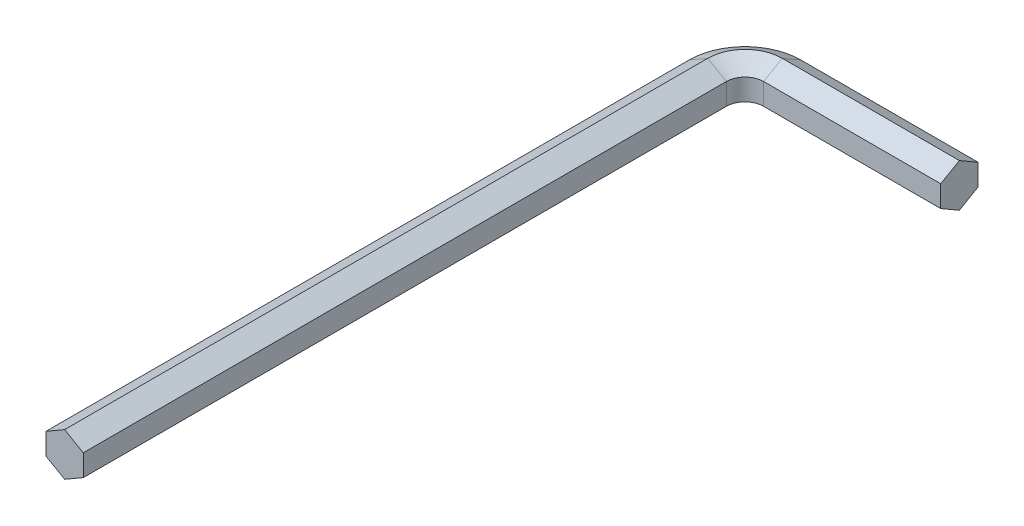
ISO-10303-21;
HEADER;
FILE_DESCRIPTION(('STEP AP214'),'2;1');
FILE_NAME('part.step','',(''),(''),'','','');
FILE_SCHEMA(('AUTOMOTIVE_DESIGN { 1 0 10303 214 1 1 1 1 }'));
ENDSEC;
DATA;
#1=APPLICATION_CONTEXT('core data for automotive mechanical design processes');
#2=APPLICATION_PROTOCOL_DEFINITION('international standard','automotive_design',2000,#1);
#3=PRODUCT_CONTEXT('',#1,'mechanical');
#4=PRODUCT('Part','Part','',(#3));
#5=PRODUCT_RELATED_PRODUCT_CATEGORY('part','',(#4));
#6=PRODUCT_DEFINITION_FORMATION('','',#4);
#7=PRODUCT_DEFINITION_CONTEXT('part definition',#1,'design');
#8=PRODUCT_DEFINITION('design','',#6,#7);
#9=PRODUCT_DEFINITION_SHAPE('','',#8);
#10=(LENGTH_UNIT() NAMED_UNIT(*) SI_UNIT(.MILLI.,.METRE.));
#11=(NAMED_UNIT(*) PLANE_ANGLE_UNIT() SI_UNIT($,.RADIAN.));
#12=(NAMED_UNIT(*) SI_UNIT($,.STERADIAN.) SOLID_ANGLE_UNIT());
#13=UNCERTAINTY_MEASURE_WITH_UNIT(LENGTH_MEASURE(1.E-05),#10,'distance_accuracy_value','');
#14=(GEOMETRIC_REPRESENTATION_CONTEXT(3) GLOBAL_UNCERTAINTY_ASSIGNED_CONTEXT((#13)) GLOBAL_UNIT_ASSIGNED_CONTEXT((#10,
#11,#12)) REPRESENTATION_CONTEXT('',''));
#15=CARTESIAN_POINT('',(0.,0.,0.));
#16=DIRECTION('',(0.,0.,1.));
#17=DIRECTION('',(1.,0.,0.));
#18=AXIS2_PLACEMENT_3D('',#15,#16,#17);
#19=CARTESIAN_POINT('',(75.,0.,0.));
#20=DIRECTION('',(0.,0.,-1.));
#21=DIRECTION('',(-1.,0.,0.));
#22=AXIS2_PLACEMENT_3D('',#19,#20,#21);
#23=PLANE('',#22);
#24=DIRECTION('',(-0.866025403784439,0.5,0.));
#25=VECTOR('',#24,1.);
#26=CARTESIAN_POINT('',(2.,-2.3094010767585,0.));
#27=LINE('',#26,#25);
#28=CARTESIAN_POINT('',(2.,-2.3094010767585,0.));
#29=VERTEX_POINT('',#28);
#30=CARTESIAN_POINT('',(0.,-1.15470053837925,0.));
#31=VERTEX_POINT('',#30);
#32=EDGE_CURVE('E198',#29,#31,#27,.T.);
#33=ORIENTED_EDGE('',*,*,#32,.F.);
#34=DIRECTION('',(-0.866025403784438,-0.5,0.));
#35=VECTOR('',#34,1.);
#36=CARTESIAN_POINT('',(4.,-1.15470053837925,0.));
#37=LINE('',#36,#35);
#38=CARTESIAN_POINT('',(4.,-1.15470053837925,0.));
#39=VERTEX_POINT('',#38);
#40=EDGE_CURVE('E260',#39,#29,#37,.T.);
#41=ORIENTED_EDGE('',*,*,#40,.F.);
#42=DIRECTION('',(0.,-1.,0.));
#43=VECTOR('',#42,1.);
#44=CARTESIAN_POINT('',(4.,1.15470053837927,0.));
#45=LINE('',#44,#43);
#46=CARTESIAN_POINT('',(4.,1.15470053837927,0.));
#47=VERTEX_POINT('',#46);
#48=EDGE_CURVE('E240',#47,#39,#45,.T.);
#49=ORIENTED_EDGE('',*,*,#48,.F.);
#50=DIRECTION('',(0.866025403784439,-0.499999999999999,0.));
#51=VECTOR('',#50,1.);
#52=CARTESIAN_POINT('',(1.99999999999999,2.30940107675852,0.));
#53=LINE('',#52,#51);
#54=CARTESIAN_POINT('',(1.99999999999999,2.30940107675852,0.));
#55=VERTEX_POINT('',#54);
#56=EDGE_CURVE('E145',#55,#47,#53,.T.);
#57=ORIENTED_EDGE('',*,*,#56,.F.);
#58=DIRECTION('',(0.866025403784438,0.500000000000001,0.));
#59=VECTOR('',#58,1.);
#60=CARTESIAN_POINT('',(0.,1.15470053837928,0.));
#61=LINE('',#60,#59);
#62=CARTESIAN_POINT('',(0.,1.15470053837928,0.));
#63=VERTEX_POINT('',#62);
#64=EDGE_CURVE('E149',#63,#55,#61,.T.);
#65=ORIENTED_EDGE('',*,*,#64,.F.);
#66=DIRECTION('',(0.,1.,0.));
#67=VECTOR('',#66,1.);
#68=CARTESIAN_POINT('',(0.,-1.15470053837925,0.));
#69=LINE('',#68,#67);
#70=EDGE_CURVE('E154',#31,#63,#69,.T.);
#71=ORIENTED_EDGE('',*,*,#70,.F.);
#72=EDGE_LOOP('',(#33,#41,#49,#57,#65,#71));
#73=FACE_BOUND('',#72,.T.);
#74=ADVANCED_FACE('F43',(#73),#23,.F.);
#75=CARTESIAN_POINT('',(25.,0.,0.));
#76=DIRECTION('',(1.,0.,0.));
#77=DIRECTION('',(0.,0.,-1.));
#78=AXIS2_PLACEMENT_3D('',#75,#76,#77);
#79=PLANE('',#78);
#80=DIRECTION('',(0.,0.5,-0.866025403784439));
#81=VECTOR('',#80,1.);
#82=CARTESIAN_POINT('',(25.,-2.3094010767585,-73.));
#83=LINE('',#82,#81);
#84=CARTESIAN_POINT('',(25.,-2.3094010767585,-73.));
#85=VERTEX_POINT('',#84);
#86=CARTESIAN_POINT('',(25.,-1.15470053837925,-75.));
#87=VERTEX_POINT('',#86);
#88=EDGE_CURVE('E165',#85,#87,#83,.T.);
#89=ORIENTED_EDGE('',*,*,#88,.T.);
#90=DIRECTION('',(0.,1.,0.));
#91=VECTOR('',#90,1.);
#92=CARTESIAN_POINT('',(25.,-1.15470053837925,-75.));
#93=LINE('',#92,#91);
#94=CARTESIAN_POINT('',(25.,1.15470053837928,-75.));
#95=VERTEX_POINT('',#94);
#96=EDGE_CURVE('E168',#87,#95,#93,.T.);
#97=ORIENTED_EDGE('',*,*,#96,.T.);
#98=DIRECTION('',(0.,0.500000000000001,0.866025403784438));
#99=VECTOR('',#98,1.);
#100=CARTESIAN_POINT('',(25.,1.15470053837928,-75.));
#101=LINE('',#100,#99);
#102=CARTESIAN_POINT('',(25.,2.30940107675852,-73.));
#103=VERTEX_POINT('',#102);
#104=EDGE_CURVE('E218',#95,#103,#101,.T.);
#105=ORIENTED_EDGE('',*,*,#104,.T.);
#106=DIRECTION('',(0.,-0.499999999999999,0.866025403784439));
#107=VECTOR('',#106,1.);
#108=CARTESIAN_POINT('',(25.,2.30940107675852,-73.));
#109=LINE('',#108,#107);
#110=CARTESIAN_POINT('',(25.,1.15470053837927,-71.));
#111=VERTEX_POINT('',#110);
#112=EDGE_CURVE('E63',#103,#111,#109,.T.);
#113=ORIENTED_EDGE('',*,*,#112,.T.);
#114=DIRECTION('',(0.,-1.,0.));
#115=VECTOR('',#114,1.);
#116=CARTESIAN_POINT('',(25.,1.15470053837927,-71.));
#117=LINE('',#116,#115);
#118=CARTESIAN_POINT('',(25.,-1.15470053837925,-71.));
#119=VERTEX_POINT('',#118);
#120=EDGE_CURVE('E57',#111,#119,#117,.T.);
#121=ORIENTED_EDGE('',*,*,#120,.T.);
#122=DIRECTION('',(0.,-0.5,-0.866025403784438));
#123=VECTOR('',#122,1.);
#124=CARTESIAN_POINT('',(25.,-1.15470053837925,-71.));
#125=LINE('',#124,#123);
#126=EDGE_CURVE('E11',#119,#85,#125,.T.);
#127=ORIENTED_EDGE('',*,*,#126,.T.);
#128=EDGE_LOOP('',(#89,#97,#105,#113,#121,#127));
#129=FACE_BOUND('',#128,.T.);
#130=ADVANCED_FACE('F167',(#129),#79,.T.);
#131=CARTESIAN_POINT('',(2.,-2.3094010767585,0.));
#132=DIRECTION('',(-0.5,-0.866025403784439,0.));
#133=DIRECTION('',(0.866025403784439,-0.5,0.));
#134=AXIS2_PLACEMENT_3D('',#131,#132,#133);
#135=PLANE('',#134);
#136=DIRECTION('',(0.,0.,-1.));
#137=VECTOR('',#136,1.);
#138=CARTESIAN_POINT('',(0.,-1.15470053837925,0.));
#139=LINE('',#138,#137);
#140=CARTESIAN_POINT('',(0.,-1.15470053837925,-69.));
#141=VERTEX_POINT('',#140);
#142=EDGE_CURVE('E204',#31,#141,#139,.T.);
#143=ORIENTED_EDGE('',*,*,#142,.T.);
#144=DIRECTION('',(-0.866025403784439,0.5,0.));
#145=VECTOR('',#144,1.);
#146=CARTESIAN_POINT('',(2.,-2.3094010767585,-69.));
#147=LINE('',#146,#145);
#148=CARTESIAN_POINT('',(2.,-2.3094010767585,-69.));
#149=VERTEX_POINT('',#148);
#150=EDGE_CURVE('E305',#149,#141,#147,.T.);
#151=ORIENTED_EDGE('',*,*,#150,.F.);
#152=DIRECTION('',(0.,0.,-1.));
#153=VECTOR('',#152,1.);
#154=CARTESIAN_POINT('',(2.,-2.3094010767585,0.));
#155=LINE('',#154,#153);
#156=EDGE_CURVE('E281',#29,#149,#155,.T.);
#157=ORIENTED_EDGE('',*,*,#156,.F.);
#158=ORIENTED_EDGE('',*,*,#32,.T.);
#159=EDGE_LOOP('',(#143,#151,#157,#158));
#160=FACE_BOUND('',#159,.T.);
#161=ADVANCED_FACE('F315',(#160),#135,.T.);
#162=CARTESIAN_POINT('',(0.,-1.15470053837925,0.));
#163=DIRECTION('',(-1.,0.,0.));
#164=DIRECTION('',(0.,0.,1.));
#165=AXIS2_PLACEMENT_3D('',#162,#163,#164);
#166=PLANE('',#165);
#167=DIRECTION('',(0.,0.,-1.));
#168=VECTOR('',#167,1.);
#169=CARTESIAN_POINT('',(0.,1.15470053837928,0.));
#170=LINE('',#169,#168);
#171=CARTESIAN_POINT('',(0.,1.15470053837928,-69.));
#172=VERTEX_POINT('',#171);
#173=EDGE_CURVE('E203',#63,#172,#170,.T.);
#174=ORIENTED_EDGE('',*,*,#173,.T.);
#175=DIRECTION('',(0.,1.,0.));
#176=VECTOR('',#175,1.);
#177=CARTESIAN_POINT('',(0.,-1.15470053837925,-69.));
#178=LINE('',#177,#176);
#179=EDGE_CURVE('E199',#141,#172,#178,.T.);
#180=ORIENTED_EDGE('',*,*,#179,.F.);
#181=ORIENTED_EDGE('',*,*,#142,.F.);
#182=ORIENTED_EDGE('',*,*,#70,.T.);
#183=EDGE_LOOP('',(#174,#180,#181,#182));
#184=FACE_BOUND('',#183,.T.);
#185=ADVANCED_FACE('F318',(#184),#166,.T.);
#186=CARTESIAN_POINT('',(0.,1.15470053837928,0.));
#187=DIRECTION('',(-0.500000000000001,0.866025403784438,0.));
#188=DIRECTION('',(-0.866025403784438,-0.500000000000001,0.));
#189=AXIS2_PLACEMENT_3D('',#186,#187,#188);
#190=PLANE('',#189);
#191=DIRECTION('',(0.,0.,-1.));
#192=VECTOR('',#191,1.);
#193=CARTESIAN_POINT('',(1.99999999999999,2.30940107675852,0.));
#194=LINE('',#193,#192);
#195=CARTESIAN_POINT('',(1.99999999999999,2.30940107675852,-69.));
#196=VERTEX_POINT('',#195);
#197=EDGE_CURVE('E223',#55,#196,#194,.T.);
#198=ORIENTED_EDGE('',*,*,#197,.T.);
#199=DIRECTION('',(0.866025403784438,0.500000000000001,0.));
#200=VECTOR('',#199,1.);
#201=CARTESIAN_POINT('',(0.,1.15470053837928,-69.));
#202=LINE('',#201,#200);
#203=EDGE_CURVE('E208',#172,#196,#202,.T.);
#204=ORIENTED_EDGE('',*,*,#203,.F.);
#205=ORIENTED_EDGE('',*,*,#173,.F.);
#206=ORIENTED_EDGE('',*,*,#64,.T.);
#207=EDGE_LOOP('',(#198,#204,#205,#206));
#208=FACE_BOUND('',#207,.T.);
#209=ADVANCED_FACE('F375',(#208),#190,.T.);
#210=CARTESIAN_POINT('',(1.99999999999999,2.30940107675852,0.));
#211=DIRECTION('',(0.499999999999999,0.866025403784439,0.));
#212=DIRECTION('',(-0.866025403784439,0.499999999999999,0.));
#213=AXIS2_PLACEMENT_3D('',#210,#211,#212);
#214=PLANE('',#213);
#215=DIRECTION('',(0.,0.,-1.));
#216=VECTOR('',#215,1.);
#217=CARTESIAN_POINT('',(4.,1.15470053837927,0.));
#218=LINE('',#217,#216);
#219=CARTESIAN_POINT('',(4.,1.15470053837927,-69.));
#220=VERTEX_POINT('',#219);
#221=EDGE_CURVE('E243',#47,#220,#218,.T.);
#222=ORIENTED_EDGE('',*,*,#221,.T.);
#223=DIRECTION('',(0.866025403784439,-0.499999999999999,0.));
#224=VECTOR('',#223,1.);
#225=CARTESIAN_POINT('',(1.99999999999999,2.30940107675852,-69.));
#226=LINE('',#225,#224);
#227=EDGE_CURVE('E227',#196,#220,#226,.T.);
#228=ORIENTED_EDGE('',*,*,#227,.F.);
#229=ORIENTED_EDGE('',*,*,#197,.F.);
#230=ORIENTED_EDGE('',*,*,#56,.T.);
#231=EDGE_LOOP('',(#222,#228,#229,#230));
#232=FACE_BOUND('',#231,.T.);
#233=ADVANCED_FACE('F384',(#232),#214,.T.);
#234=CARTESIAN_POINT('',(4.,1.15470053837927,0.));
#235=DIRECTION('',(1.,0.,0.));
#236=DIRECTION('',(0.,0.,-1.));
#237=AXIS2_PLACEMENT_3D('',#234,#235,#236);
#238=PLANE('',#237);
#239=DIRECTION('',(0.,0.,-1.));
#240=VECTOR('',#239,1.);
#241=CARTESIAN_POINT('',(4.,-1.15470053837925,0.));
#242=LINE('',#241,#240);
#243=CARTESIAN_POINT('',(4.,-1.15470053837925,-69.));
#244=VERTEX_POINT('',#243);
#245=EDGE_CURVE('E263',#39,#244,#242,.T.);
#246=ORIENTED_EDGE('',*,*,#245,.T.);
#247=DIRECTION('',(0.,-1.,0.));
#248=VECTOR('',#247,1.);
#249=CARTESIAN_POINT('',(4.,1.15470053837927,-69.));
#250=LINE('',#249,#248);
#251=EDGE_CURVE('E247',#220,#244,#250,.T.);
#252=ORIENTED_EDGE('',*,*,#251,.F.);
#253=ORIENTED_EDGE('',*,*,#221,.F.);
#254=ORIENTED_EDGE('',*,*,#48,.T.);
#255=EDGE_LOOP('',(#246,#252,#253,#254));
#256=FACE_BOUND('',#255,.T.);
#257=ADVANCED_FACE('F395',(#256),#238,.T.);
#258=CARTESIAN_POINT('',(4.,-1.15470053837925,0.));
#259=DIRECTION('',(0.5,-0.866025403784438,0.));
#260=DIRECTION('',(0.866025403784438,0.5,0.));
#261=AXIS2_PLACEMENT_3D('',#258,#259,#260);
#262=PLANE('',#261);
#263=DIRECTION('',(-0.866025403784438,-0.5,0.));
#264=VECTOR('',#263,1.);
#265=CARTESIAN_POINT('',(4.,-1.15470053837925,-69.));
#266=LINE('',#265,#264);
#267=EDGE_CURVE('E267',#244,#149,#266,.T.);
#268=ORIENTED_EDGE('',*,*,#267,.F.);
#269=ORIENTED_EDGE('',*,*,#245,.F.);
#270=ORIENTED_EDGE('',*,*,#40,.T.);
#271=ORIENTED_EDGE('',*,*,#156,.T.);
#272=EDGE_LOOP('',(#268,#269,#270,#271));
#273=FACE_BOUND('',#272,.T.);
#274=ADVANCED_FACE('F331',(#273),#262,.T.);
#275=CARTESIAN_POINT('',(6.,-2.3094010767585,-69.));
#276=DIRECTION('',(0.,1.,0.));
#277=DIRECTION('',(0.,0.,1.));
#278=AXIS2_PLACEMENT_3D('',#275,#276,#277);
#279=CONICAL_SURFACE('',#278,4.,1.0471975511966);
#280=CARTESIAN_POINT('',(6.,-1.15470053837925,-69.));
#281=DIRECTION('',(0.,-1.,0.));
#282=DIRECTION('',(-1.,0.,0.));
#283=AXIS2_PLACEMENT_3D('',#280,#281,#282);
#284=CIRCLE('',#283,6.);
#285=CARTESIAN_POINT('',(6.00000000000001,-1.15470053837925,-75.));
#286=VERTEX_POINT('',#285);
#287=EDGE_CURVE('E212',#141,#286,#284,.T.);
#288=ORIENTED_EDGE('',*,*,#287,.T.);
#289=DIRECTION('',(0.,0.5,-0.866025403784439));
#290=VECTOR('',#289,1.);
#291=CARTESIAN_POINT('',(6.00000000000001,-2.3094010767585,-73.));
#292=LINE('',#291,#290);
#293=CARTESIAN_POINT('',(6.00000000000001,-2.3094010767585,-73.));
#294=VERTEX_POINT('',#293);
#295=EDGE_CURVE('E188',#294,#286,#292,.T.);
#296=ORIENTED_EDGE('',*,*,#295,.F.);
#297=CARTESIAN_POINT('',(6.,-2.3094010767585,-69.));
#298=DIRECTION('',(0.,-1.,0.));
#299=DIRECTION('',(-1.,0.,0.));
#300=AXIS2_PLACEMENT_3D('',#297,#298,#299);
#301=CIRCLE('',#300,4.);
#302=EDGE_CURVE('E284',#149,#294,#301,.T.);
#303=ORIENTED_EDGE('',*,*,#302,.F.);
#304=ORIENTED_EDGE('',*,*,#150,.T.);
#305=EDGE_LOOP('',(#288,#296,#303,#304));
#306=FACE_BOUND('',#305,.T.);
#307=ADVANCED_FACE('F291',(#306),#279,.T.);
#308=CARTESIAN_POINT('',(6.,0.,-69.));
#309=DIRECTION('',(0.,-1.,0.));
#310=DIRECTION('',(0.,0.,-1.));
#311=AXIS2_PLACEMENT_3D('',#308,#309,#310);
#312=CYLINDRICAL_SURFACE('',#311,6.);
#313=CARTESIAN_POINT('',(6.,1.15470053837928,-69.));
#314=DIRECTION('',(0.,-1.,0.));
#315=DIRECTION('',(-1.,0.,0.));
#316=AXIS2_PLACEMENT_3D('',#313,#314,#315);
#317=CIRCLE('',#316,6.);
#318=CARTESIAN_POINT('',(6.00000000000001,1.15470053837928,-75.));
#319=VERTEX_POINT('',#318);
#320=EDGE_CURVE('E132',#172,#319,#317,.T.);
#321=ORIENTED_EDGE('',*,*,#320,.T.);
#322=DIRECTION('',(0.,1.,0.));
#323=VECTOR('',#322,1.);
#324=CARTESIAN_POINT('',(6.00000000000001,-1.15470053837925,-75.));
#325=LINE('',#324,#323);
#326=EDGE_CURVE('E209',#286,#319,#325,.T.);
#327=ORIENTED_EDGE('',*,*,#326,.F.);
#328=ORIENTED_EDGE('',*,*,#287,.F.);
#329=ORIENTED_EDGE('',*,*,#179,.T.);
#330=EDGE_LOOP('',(#321,#327,#328,#329));
#331=FACE_BOUND('',#330,.T.);
#332=ADVANCED_FACE('F321',(#331),#312,.T.);
#333=CARTESIAN_POINT('',(6.,1.15470053837928,-69.));
#334=DIRECTION('',(0.,-1.,0.));
#335=DIRECTION('',(0.,0.,-1.));
#336=AXIS2_PLACEMENT_3D('',#333,#334,#335);
#337=CONICAL_SURFACE('',#336,6.,1.0471975511966);
#338=CARTESIAN_POINT('',(6.,2.30940107675852,-69.));
#339=DIRECTION('',(0.,-1.,0.));
#340=DIRECTION('',(-1.,0.,0.));
#341=AXIS2_PLACEMENT_3D('',#338,#339,#340);
#342=CIRCLE('',#341,4.00000000000001);
#343=CARTESIAN_POINT('',(6.00000000000001,2.30940107675852,-73.));
#344=VERTEX_POINT('',#343);
#345=EDGE_CURVE('E123',#196,#344,#342,.T.);
#346=ORIENTED_EDGE('',*,*,#345,.T.);
#347=DIRECTION('',(0.,0.500000000000001,0.866025403784438));
#348=VECTOR('',#347,1.);
#349=CARTESIAN_POINT('',(6.00000000000001,1.15470053837928,-75.));
#350=LINE('',#349,#348);
#351=EDGE_CURVE('E214',#319,#344,#350,.T.);
#352=ORIENTED_EDGE('',*,*,#351,.F.);
#353=ORIENTED_EDGE('',*,*,#320,.F.);
#354=ORIENTED_EDGE('',*,*,#203,.T.);
#355=EDGE_LOOP('',(#346,#352,#353,#354));
#356=FACE_BOUND('',#355,.T.);
#357=ADVANCED_FACE('F323',(#356),#337,.T.);
#358=CARTESIAN_POINT('',(6.,2.30940107675852,-69.));
#359=DIRECTION('',(0.,1.,0.));
#360=DIRECTION('',(0.,0.,1.));
#361=AXIS2_PLACEMENT_3D('',#358,#359,#360);
#362=CONICAL_SURFACE('',#361,4.00000000000001,1.0471975511966);
#363=CARTESIAN_POINT('',(6.,1.15470053837927,-69.));
#364=DIRECTION('',(0.,-1.,0.));
#365=DIRECTION('',(-1.,0.,0.));
#366=AXIS2_PLACEMENT_3D('',#363,#364,#365);
#367=CIRCLE('',#366,2.);
#368=CARTESIAN_POINT('',(6.00000000000001,1.15470053837927,-71.));
#369=VERTEX_POINT('',#368);
#370=EDGE_CURVE('E116',#220,#369,#367,.T.);
#371=ORIENTED_EDGE('',*,*,#370,.T.);
#372=DIRECTION('',(0.,-0.499999999999999,0.866025403784439));
#373=VECTOR('',#372,1.);
#374=CARTESIAN_POINT('',(6.00000000000001,2.30940107675852,-73.));
#375=LINE('',#374,#373);
#376=EDGE_CURVE('E233',#344,#369,#375,.T.);
#377=ORIENTED_EDGE('',*,*,#376,.F.);
#378=ORIENTED_EDGE('',*,*,#345,.F.);
#379=ORIENTED_EDGE('',*,*,#227,.T.);
#380=EDGE_LOOP('',(#371,#377,#378,#379));
#381=FACE_BOUND('',#380,.T.);
#382=ADVANCED_FACE('F329',(#381),#362,.F.);
#383=CARTESIAN_POINT('',(6.,0.,-69.));
#384=DIRECTION('',(0.,-1.,0.));
#385=DIRECTION('',(0.,0.,-1.));
#386=AXIS2_PLACEMENT_3D('',#383,#384,#385);
#387=CYLINDRICAL_SURFACE('',#386,2.);
#388=CARTESIAN_POINT('',(6.,-1.15470053837925,-69.));
#389=DIRECTION('',(0.,-1.,0.));
#390=DIRECTION('',(-1.,0.,0.));
#391=AXIS2_PLACEMENT_3D('',#388,#389,#390);
#392=CIRCLE('',#391,2.);
#393=CARTESIAN_POINT('',(6.00000000000001,-1.15470053837925,-71.));
#394=VERTEX_POINT('',#393);
#395=EDGE_CURVE('E270',#244,#394,#392,.T.);
#396=ORIENTED_EDGE('',*,*,#395,.T.);
#397=DIRECTION('',(0.,-1.,0.));
#398=VECTOR('',#397,1.);
#399=CARTESIAN_POINT('',(6.00000000000001,1.15470053837927,-71.));
#400=LINE('',#399,#398);
#401=EDGE_CURVE('E252',#369,#394,#400,.T.);
#402=ORIENTED_EDGE('',*,*,#401,.F.);
#403=ORIENTED_EDGE('',*,*,#370,.F.);
#404=ORIENTED_EDGE('',*,*,#251,.T.);
#405=EDGE_LOOP('',(#396,#402,#403,#404));
#406=FACE_BOUND('',#405,.T.);
#407=ADVANCED_FACE('F444',(#406),#387,.F.);
#408=CARTESIAN_POINT('',(6.,-1.15470053837925,-69.));
#409=DIRECTION('',(0.,-1.,0.));
#410=DIRECTION('',(0.,0.,-1.));
#411=AXIS2_PLACEMENT_3D('',#408,#409,#410);
#412=CONICAL_SURFACE('',#411,2.,1.0471975511966);
#413=DIRECTION('',(0.,-0.5,-0.866025403784438));
#414=VECTOR('',#413,1.);
#415=CARTESIAN_POINT('',(6.00000000000001,-1.15470053837925,-71.));
#416=LINE('',#415,#414);
#417=EDGE_CURVE('E195',#394,#294,#416,.T.);
#418=ORIENTED_EDGE('',*,*,#417,.F.);
#419=ORIENTED_EDGE('',*,*,#395,.F.);
#420=ORIENTED_EDGE('',*,*,#267,.T.);
#421=ORIENTED_EDGE('',*,*,#302,.T.);
#422=EDGE_LOOP('',(#418,#419,#420,#421));
#423=FACE_BOUND('',#422,.T.);
#424=ADVANCED_FACE('F295',(#423),#412,.F.);
#425=CARTESIAN_POINT('',(6.00000000000001,-2.3094010767585,-73.));
#426=DIRECTION('',(0.,-0.866025403784439,-0.5));
#427=DIRECTION('',(0.,0.5,-0.866025403784439));
#428=AXIS2_PLACEMENT_3D('',#425,#426,#427);
#429=PLANE('',#428);
#430=DIRECTION('',(1.,0.,0.));
#431=VECTOR('',#430,1.);
#432=CARTESIAN_POINT('',(6.00000000000001,-1.15470053837925,-75.));
#433=LINE('',#432,#431);
#434=EDGE_CURVE('E174',#286,#87,#433,.T.);
#435=ORIENTED_EDGE('',*,*,#434,.T.);
#436=ORIENTED_EDGE('',*,*,#88,.F.);
#437=DIRECTION('',(1.,0.,0.));
#438=VECTOR('',#437,1.);
#439=CARTESIAN_POINT('',(6.00000000000001,-2.3094010767585,-73.));
#440=LINE('',#439,#438);
#441=EDGE_CURVE('E175',#294,#85,#440,.T.);
#442=ORIENTED_EDGE('',*,*,#441,.F.);
#443=ORIENTED_EDGE('',*,*,#295,.T.);
#444=EDGE_LOOP('',(#435,#436,#442,#443));
#445=FACE_BOUND('',#444,.T.);
#446=ADVANCED_FACE('F186',(#445),#429,.T.);
#447=CARTESIAN_POINT('',(6.00000000000001,-1.15470053837925,-75.));
#448=DIRECTION('',(0.,0.,-1.));
#449=DIRECTION('',(-1.,0.,0.));
#450=AXIS2_PLACEMENT_3D('',#447,#448,#449);
#451=PLANE('',#450);
#452=DIRECTION('',(1.,0.,0.));
#453=VECTOR('',#452,1.);
#454=CARTESIAN_POINT('',(6.00000000000001,1.15470053837928,-75.));
#455=LINE('',#454,#453);
#456=EDGE_CURVE('E182',#319,#95,#455,.T.);
#457=ORIENTED_EDGE('',*,*,#456,.T.);
#458=ORIENTED_EDGE('',*,*,#96,.F.);
#459=ORIENTED_EDGE('',*,*,#434,.F.);
#460=ORIENTED_EDGE('',*,*,#326,.T.);
#461=EDGE_LOOP('',(#457,#458,#459,#460));
#462=FACE_BOUND('',#461,.T.);
#463=ADVANCED_FACE('F179',(#462),#451,.T.);
#464=CARTESIAN_POINT('',(6.00000000000001,1.15470053837928,-75.));
#465=DIRECTION('',(0.,0.866025403784438,-0.500000000000001));
#466=DIRECTION('',(0.,0.500000000000001,0.866025403784438));
#467=AXIS2_PLACEMENT_3D('',#464,#465,#466);
#468=PLANE('',#467);
#469=DIRECTION('',(1.,0.,0.));
#470=VECTOR('',#469,1.);
#471=CARTESIAN_POINT('',(6.00000000000001,2.30940107675852,-73.));
#472=LINE('',#471,#470);
#473=EDGE_CURVE('E101',#344,#103,#472,.T.);
#474=ORIENTED_EDGE('',*,*,#473,.T.);
#475=ORIENTED_EDGE('',*,*,#104,.F.);
#476=ORIENTED_EDGE('',*,*,#456,.F.);
#477=ORIENTED_EDGE('',*,*,#351,.T.);
#478=EDGE_LOOP('',(#474,#475,#476,#477));
#479=FACE_BOUND('',#478,.T.);
#480=ADVANCED_FACE('F480',(#479),#468,.T.);
#481=CARTESIAN_POINT('',(6.00000000000001,2.30940107675852,-73.));
#482=DIRECTION('',(0.,0.866025403784439,0.499999999999999));
#483=DIRECTION('',(0.,-0.499999999999999,0.866025403784439));
#484=AXIS2_PLACEMENT_3D('',#481,#482,#483);
#485=PLANE('',#484);
#486=DIRECTION('',(1.,0.,0.));
#487=VECTOR('',#486,1.);
#488=CARTESIAN_POINT('',(6.00000000000001,1.15470053837927,-71.));
#489=LINE('',#488,#487);
#490=EDGE_CURVE('E93',#369,#111,#489,.T.);
#491=ORIENTED_EDGE('',*,*,#490,.T.);
#492=ORIENTED_EDGE('',*,*,#112,.F.);
#493=ORIENTED_EDGE('',*,*,#473,.F.);
#494=ORIENTED_EDGE('',*,*,#376,.T.);
#495=EDGE_LOOP('',(#491,#492,#493,#494));
#496=FACE_BOUND('',#495,.T.);
#497=ADVANCED_FACE('F341',(#496),#485,.T.);
#498=CARTESIAN_POINT('',(6.00000000000001,1.15470053837927,-71.));
#499=DIRECTION('',(0.,0.,1.));
#500=DIRECTION('',(1.,0.,0.));
#501=AXIS2_PLACEMENT_3D('',#498,#499,#500);
#502=PLANE('',#501);
#503=DIRECTION('',(1.,0.,0.));
#504=VECTOR('',#503,1.);
#505=CARTESIAN_POINT('',(6.00000000000001,-1.15470053837925,-71.));
#506=LINE('',#505,#504);
#507=EDGE_CURVE('E51',#394,#119,#506,.T.);
#508=ORIENTED_EDGE('',*,*,#507,.T.);
#509=ORIENTED_EDGE('',*,*,#120,.F.);
#510=ORIENTED_EDGE('',*,*,#490,.F.);
#511=ORIENTED_EDGE('',*,*,#401,.T.);
#512=EDGE_LOOP('',(#508,#509,#510,#511));
#513=FACE_BOUND('',#512,.T.);
#514=ADVANCED_FACE('F336',(#513),#502,.T.);
#515=CARTESIAN_POINT('',(6.00000000000001,-1.15470053837925,-71.));
#516=DIRECTION('',(0.,-0.866025403784438,0.500000000000001));
#517=DIRECTION('',(0.,-0.500000000000001,-0.866025403784438));
#518=AXIS2_PLACEMENT_3D('',#515,#516,#517);
#519=PLANE('',#518);
#520=ORIENTED_EDGE('',*,*,#126,.F.);
#521=ORIENTED_EDGE('',*,*,#507,.F.);
#522=ORIENTED_EDGE('',*,*,#417,.T.);
#523=ORIENTED_EDGE('',*,*,#441,.T.);
#524=EDGE_LOOP('',(#520,#521,#522,#523));
#525=FACE_BOUND('',#524,.T.);
#526=ADVANCED_FACE('F286',(#525),#519,.T.);
#527=CLOSED_SHELL('',(#74,#130,#161,#185,#209,#233,#257,#274,#307,#332,#357,#382,#407,#424,#446,
#463,#480,#497,#514,#526));
#528=MANIFOLD_SOLID_BREP('B2',#527);
#529=ADVANCED_BREP_SHAPE_REPRESENTATION('',(#18,#528),#14);
#530=SHAPE_DEFINITION_REPRESENTATION(#9,#529);
ENDSEC;
END-ISO-10303-21;
